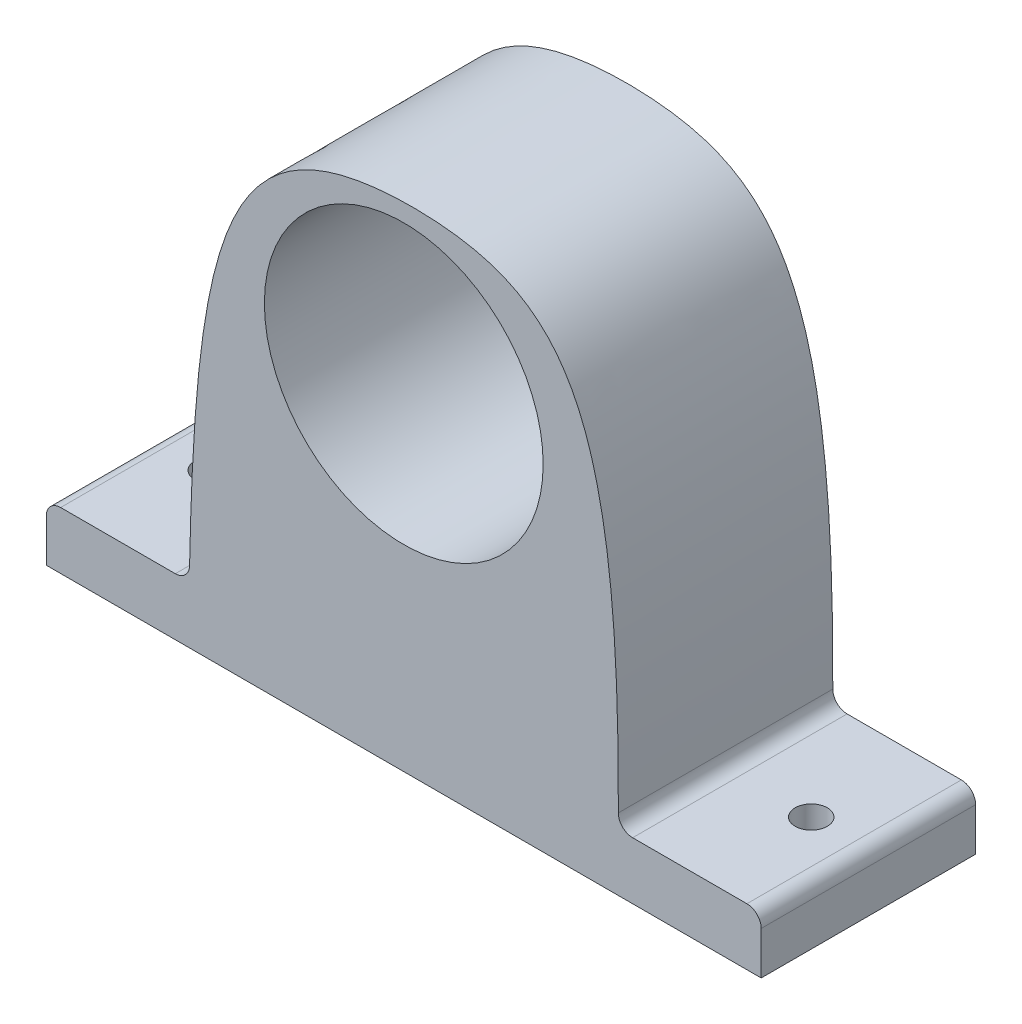
ISO-10303-21;
HEADER;
FILE_DESCRIPTION(('STEP AP214'),'2;1');
FILE_NAME('part.step','',(''),(''),'','','');
FILE_SCHEMA(('AUTOMOTIVE_DESIGN { 1 0 10303 214 1 1 1 1 }'));
ENDSEC;
DATA;
#1=APPLICATION_CONTEXT('core data for automotive mechanical design processes');
#2=APPLICATION_PROTOCOL_DEFINITION('international standard','automotive_design',2000,#1);
#3=PRODUCT_CONTEXT('',#1,'mechanical');
#4=PRODUCT('Part','Part','',(#3));
#5=PRODUCT_RELATED_PRODUCT_CATEGORY('part','',(#4));
#6=PRODUCT_DEFINITION_FORMATION('','',#4);
#7=PRODUCT_DEFINITION_CONTEXT('part definition',#1,'design');
#8=PRODUCT_DEFINITION('design','',#6,#7);
#9=PRODUCT_DEFINITION_SHAPE('','',#8);
#10=(LENGTH_UNIT() NAMED_UNIT(*) SI_UNIT(.MILLI.,.METRE.));
#11=(NAMED_UNIT(*) PLANE_ANGLE_UNIT() SI_UNIT($,.RADIAN.));
#12=(NAMED_UNIT(*) SI_UNIT($,.STERADIAN.) SOLID_ANGLE_UNIT());
#13=UNCERTAINTY_MEASURE_WITH_UNIT(LENGTH_MEASURE(1.E-05),#10,'distance_accuracy_value','');
#14=(GEOMETRIC_REPRESENTATION_CONTEXT(3) GLOBAL_UNCERTAINTY_ASSIGNED_CONTEXT((#13)) GLOBAL_UNIT_ASSIGNED_CONTEXT((#10,
#11,#12)) REPRESENTATION_CONTEXT('',''));
#15=CARTESIAN_POINT('',(0.,0.,0.));
#16=DIRECTION('',(0.,0.,1.));
#17=DIRECTION('',(1.,0.,0.));
#18=AXIS2_PLACEMENT_3D('',#15,#16,#17);
#19=CARTESIAN_POINT('',(0.,8.,0.));
#20=DIRECTION('',(0.,1.,0.));
#21=DIRECTION('',(0.,0.,1.));
#22=AXIS2_PLACEMENT_3D('',#19,#20,#21);
#23=PLANE('',#22);
#24=CARTESIAN_POINT('',(42.,8.,0.));
#25=DIRECTION('',(0.,1.,0.));
#26=DIRECTION('',(0.,0.,1.));
#27=AXIS2_PLACEMENT_3D('',#24,#25,#26);
#28=CIRCLE('',#27,2.25);
#29=CARTESIAN_POINT('',(42.,8.,2.25));
#30=VERTEX_POINT('',#29);
#31=EDGE_CURVE('E266',#30,#30,#28,.T.);
#32=ORIENTED_EDGE('',*,*,#31,.F.);
#33=EDGE_LOOP('',(#32));
#34=FACE_BOUND('',#33,.T.);
#35=DIRECTION('',(-1.,0.,0.));
#36=VECTOR('',#35,1.);
#37=CARTESIAN_POINT('',(-50.,8.,-15.));
#38=LINE('',#37,#36);
#39=CARTESIAN_POINT('',(48.,8.,-15.));
#40=VERTEX_POINT('',#39);
#41=CARTESIAN_POINT('',(32.0143725813341,8.,-15.));
#42=VERTEX_POINT('',#41);
#43=EDGE_CURVE('E202',#40,#42,#38,.T.);
#44=ORIENTED_EDGE('',*,*,#43,.T.);
#45=DIRECTION('',(0.,0.,-1.));
#46=VECTOR('',#45,1.);
#47=CARTESIAN_POINT('',(32.0143725813341,8.,15.));
#48=LINE('',#47,#46);
#49=CARTESIAN_POINT('',(32.0143725813341,8.,15.));
#50=VERTEX_POINT('',#49);
#51=EDGE_CURVE('E153',#42,#50,#48,.F.);
#52=ORIENTED_EDGE('',*,*,#51,.T.);
#53=DIRECTION('',(1.,0.,0.));
#54=VECTOR('',#53,1.);
#55=CARTESIAN_POINT('',(-50.,8.,15.));
#56=LINE('',#55,#54);
#57=CARTESIAN_POINT('',(48.,8.,15.));
#58=VERTEX_POINT('',#57);
#59=EDGE_CURVE('E190',#50,#58,#56,.T.);
#60=ORIENTED_EDGE('',*,*,#59,.T.);
#61=DIRECTION('',(0.,0.,-1.));
#62=VECTOR('',#61,1.);
#63=CARTESIAN_POINT('',(48.,8.,-15.));
#64=LINE('',#63,#62);
#65=EDGE_CURVE('E120',#58,#40,#64,.T.);
#66=ORIENTED_EDGE('',*,*,#65,.T.);
#67=EDGE_LOOP('',(#44,#52,#60,#66));
#68=FACE_BOUND('',#67,.T.);
#69=ADVANCED_FACE('F35',(#34,#68),#23,.T.);
#70=CARTESIAN_POINT('',(50.,8.,-15.));
#71=DIRECTION('',(-1.,0.,0.));
#72=DIRECTION('',(0.,0.,1.));
#73=AXIS2_PLACEMENT_3D('',#70,#71,#72);
#74=PLANE('',#73);
#75=DIRECTION('',(0.,-1.,0.));
#76=VECTOR('',#75,1.);
#77=CARTESIAN_POINT('',(50.,8.,-15.));
#78=LINE('',#77,#76);
#79=CARTESIAN_POINT('',(50.,6.,-15.));
#80=VERTEX_POINT('',#79);
#81=CARTESIAN_POINT('',(50.,0.,-15.));
#82=VERTEX_POINT('',#81);
#83=EDGE_CURVE('E111',#80,#82,#78,.T.);
#84=ORIENTED_EDGE('',*,*,#83,.F.);
#85=DIRECTION('',(0.,0.,-1.));
#86=VECTOR('',#85,1.);
#87=CARTESIAN_POINT('',(50.,6.,15.));
#88=LINE('',#87,#86);
#89=CARTESIAN_POINT('',(50.,6.,15.));
#90=VERTEX_POINT('',#89);
#91=EDGE_CURVE('E58',#80,#90,#88,.F.);
#92=ORIENTED_EDGE('',*,*,#91,.T.);
#93=DIRECTION('',(0.,-1.,0.));
#94=VECTOR('',#93,1.);
#95=CARTESIAN_POINT('',(50.,8.,15.));
#96=LINE('',#95,#94);
#97=CARTESIAN_POINT('',(50.,0.,15.));
#98=VERTEX_POINT('',#97);
#99=EDGE_CURVE('E132',#90,#98,#96,.T.);
#100=ORIENTED_EDGE('',*,*,#99,.T.);
#101=DIRECTION('',(0.,0.,-1.));
#102=VECTOR('',#101,1.);
#103=CARTESIAN_POINT('',(50.,0.,-15.));
#104=LINE('',#103,#102);
#105=EDGE_CURVE('E127',#98,#82,#104,.T.);
#106=ORIENTED_EDGE('',*,*,#105,.T.);
#107=EDGE_LOOP('',(#84,#92,#100,#106));
#108=FACE_BOUND('',#107,.T.);
#109=ADVANCED_FACE('F131',(#108),#74,.F.);
#110=CARTESIAN_POINT('',(-50.,8.,-15.));
#111=DIRECTION('',(0.,0.,1.));
#112=DIRECTION('',(1.,0.,0.));
#113=AXIS2_PLACEMENT_3D('',#110,#111,#112);
#114=PLANE('',#113);
#115=CARTESIAN_POINT('',(0.,47.,-15.));
#116=DIRECTION('',(0.,0.,1.));
#117=DIRECTION('',(1.,0.,0.));
#118=AXIS2_PLACEMENT_3D('',#115,#116,#117);
#119=CIRCLE('',#118,19.5);
#120=CARTESIAN_POINT('',(19.5,47.,-15.));
#121=VERTEX_POINT('',#120);
#122=EDGE_CURVE('E211',#121,#121,#119,.T.);
#123=ORIENTED_EDGE('',*,*,#122,.T.);
#124=EDGE_LOOP('',(#123));
#125=FACE_BOUND('',#124,.T.);
#126=ORIENTED_EDGE('',*,*,#43,.F.);
#127=CARTESIAN_POINT('',(48.,6.,-15.));
#128=DIRECTION('',(0.,0.,1.));
#129=DIRECTION('',(1.,0.,0.));
#130=AXIS2_PLACEMENT_3D('',#127,#128,#129);
#131=CIRCLE('',#130,2.);
#132=EDGE_CURVE('E118',#40,#80,#131,.F.);
#133=ORIENTED_EDGE('',*,*,#132,.T.);
#134=ORIENTED_EDGE('',*,*,#83,.T.);
#135=DIRECTION('',(-1.,0.,0.));
#136=VECTOR('',#135,1.);
#137=CARTESIAN_POINT('',(-50.,0.,-15.));
#138=LINE('',#137,#136);
#139=CARTESIAN_POINT('',(-50.,0.,-15.));
#140=VERTEX_POINT('',#139);
#141=EDGE_CURVE('E116',#82,#140,#138,.T.);
#142=ORIENTED_EDGE('',*,*,#141,.T.);
#143=DIRECTION('',(0.,-1.,0.));
#144=VECTOR('',#143,1.);
#145=CARTESIAN_POINT('',(-50.,8.,-15.));
#146=LINE('',#145,#144);
#147=CARTESIAN_POINT('',(-50.,6.,-15.));
#148=VERTEX_POINT('',#147);
#149=EDGE_CURVE('E121',#148,#140,#146,.T.);
#150=ORIENTED_EDGE('',*,*,#149,.F.);
#151=CARTESIAN_POINT('',(-48.,6.,-15.));
#152=DIRECTION('',(0.,0.,1.));
#153=DIRECTION('',(1.,0.,0.));
#154=AXIS2_PLACEMENT_3D('',#151,#152,#153);
#155=CIRCLE('',#154,2.);
#156=CARTESIAN_POINT('',(-48.,8.,-15.));
#157=VERTEX_POINT('',#156);
#158=EDGE_CURVE('E166',#148,#157,#155,.F.);
#159=ORIENTED_EDGE('',*,*,#158,.T.);
#160=CARTESIAN_POINT('',(-31.9615397004483,8.,-15.));
#161=VERTEX_POINT('',#160);
#162=EDGE_CURVE('E146',#161,#157,#38,.T.);
#163=ORIENTED_EDGE('',*,*,#162,.F.);
#164=CARTESIAN_POINT('',(-31.9615397004483,9.99999999999999,-15.));
#165=DIRECTION('',(0.,0.,1.));
#166=DIRECTION('',(1.,0.,0.));
#167=AXIS2_PLACEMENT_3D('',#164,#165,#166);
#168=CIRCLE('',#167,2.);
#169=CARTESIAN_POINT('',(-29.961975761432,9.95823813000134,-15.));
#170=VERTEX_POINT('',#169);
#171=EDGE_CURVE('E11',#161,#170,#168,.T.);
#172=ORIENTED_EDGE('',*,*,#171,.T.);
#173=CARTESIAN_POINT('',(30.,7.99999999999988,-15.));
#174=CARTESIAN_POINT('',(30.4408025854963,55.3810531329873,-15.));
#175=CARTESIAN_POINT('',(21.9240407428457,69.7151543853368,-15.));
#176=CARTESIAN_POINT('',(-25.0594519853736,68.4938476291659,-15.));
#177=CARTESIAN_POINT('',(-29.2948481921553,47.1595503730659,-15.));
#178=CARTESIAN_POINT('',(-30.,8.,-15.));
#179=B_SPLINE_CURVE_WITH_KNOTS('',3,(#173,#174,#175,#176,#177,#178),.UNSPECIFIED.,.F.,.F.,(4,1,
1,4),(0.,0.424752904805303,0.524752904805303,1.),.UNSPECIFIED.);
#180=CARTESIAN_POINT('',(30.0143972889691,10.0099413243421,-15.));
#181=VERTEX_POINT('',#180);
#182=EDGE_CURVE('E134',#170,#181,#179,.F.);
#183=ORIENTED_EDGE('',*,*,#182,.T.);
#184=CARTESIAN_POINT('',(32.0143725813341,10.,-15.));
#185=DIRECTION('',(0.,0.,1.));
#186=DIRECTION('',(1.,0.,0.));
#187=AXIS2_PLACEMENT_3D('',#184,#185,#186);
#188=CIRCLE('',#187,2.);
#189=EDGE_CURVE('E177',#181,#42,#188,.T.);
#190=ORIENTED_EDGE('',*,*,#189,.T.);
#191=EDGE_LOOP('',(#126,#133,#134,#142,#150,#159,#163,#172,#183,#190));
#192=FACE_BOUND('',#191,.T.);
#193=ADVANCED_FACE('F114',(#125,#192),#114,.F.);
#194=CARTESIAN_POINT('',(-50.,8.,-15.));
#195=DIRECTION('',(1.,0.,0.));
#196=DIRECTION('',(0.,0.,-1.));
#197=AXIS2_PLACEMENT_3D('',#194,#195,#196);
#198=PLANE('',#197);
#199=DIRECTION('',(0.,-1.,0.));
#200=VECTOR('',#199,1.);
#201=CARTESIAN_POINT('',(-50.,8.,15.));
#202=LINE('',#201,#200);
#203=CARTESIAN_POINT('',(-50.,6.,15.));
#204=VERTEX_POINT('',#203);
#205=CARTESIAN_POINT('',(-50.,0.,15.));
#206=VERTEX_POINT('',#205);
#207=EDGE_CURVE('E148',#204,#206,#202,.T.);
#208=ORIENTED_EDGE('',*,*,#207,.F.);
#209=DIRECTION('',(0.,0.,1.));
#210=VECTOR('',#209,1.);
#211=CARTESIAN_POINT('',(-50.,6.,-15.));
#212=LINE('',#211,#210);
#213=EDGE_CURVE('E173',#204,#148,#212,.F.);
#214=ORIENTED_EDGE('',*,*,#213,.T.);
#215=ORIENTED_EDGE('',*,*,#149,.T.);
#216=DIRECTION('',(0.,0.,1.));
#217=VECTOR('',#216,1.);
#218=CARTESIAN_POINT('',(-50.,0.,-15.));
#219=LINE('',#218,#217);
#220=EDGE_CURVE('E129',#140,#206,#219,.T.);
#221=ORIENTED_EDGE('',*,*,#220,.T.);
#222=EDGE_LOOP('',(#208,#214,#215,#221));
#223=FACE_BOUND('',#222,.T.);
#224=ADVANCED_FACE('F238',(#223),#198,.F.);
#225=CARTESIAN_POINT('',(-50.,8.,15.));
#226=DIRECTION('',(0.,0.,-1.));
#227=DIRECTION('',(-1.,0.,0.));
#228=AXIS2_PLACEMENT_3D('',#225,#226,#227);
#229=PLANE('',#228);
#230=CARTESIAN_POINT('',(0.,47.,15.));
#231=DIRECTION('',(0.,0.,1.));
#232=DIRECTION('',(1.,0.,0.));
#233=AXIS2_PLACEMENT_3D('',#230,#231,#232);
#234=CIRCLE('',#233,19.5);
#235=CARTESIAN_POINT('',(19.5,47.,15.));
#236=VERTEX_POINT('',#235);
#237=EDGE_CURVE('E276',#236,#236,#234,.T.);
#238=ORIENTED_EDGE('',*,*,#237,.F.);
#239=EDGE_LOOP('',(#238));
#240=FACE_BOUND('',#239,.T.);
#241=ORIENTED_EDGE('',*,*,#99,.F.);
#242=CARTESIAN_POINT('',(48.,6.,15.));
#243=DIRECTION('',(0.,0.,-1.));
#244=DIRECTION('',(-1.,0.,0.));
#245=AXIS2_PLACEMENT_3D('',#242,#243,#244);
#246=CIRCLE('',#245,2.);
#247=EDGE_CURVE('E171',#90,#58,#246,.F.);
#248=ORIENTED_EDGE('',*,*,#247,.T.);
#249=ORIENTED_EDGE('',*,*,#59,.F.);
#250=CARTESIAN_POINT('',(32.0143725813341,10.,15.));
#251=DIRECTION('',(0.,0.,-1.));
#252=DIRECTION('',(-1.,0.,0.));
#253=AXIS2_PLACEMENT_3D('',#250,#251,#252);
#254=CIRCLE('',#253,2.);
#255=CARTESIAN_POINT('',(30.0143972889691,10.0099413243421,15.));
#256=VERTEX_POINT('',#255);
#257=EDGE_CURVE('E175',#50,#256,#254,.T.);
#258=ORIENTED_EDGE('',*,*,#257,.T.);
#259=CARTESIAN_POINT('',(30.,7.99999999999988,15.));
#260=CARTESIAN_POINT('',(30.4408025854963,55.3810531329873,15.));
#261=CARTESIAN_POINT('',(21.9240407428457,69.7151543853368,15.));
#262=CARTESIAN_POINT('',(-25.0594519853736,68.4938476291659,15.));
#263=CARTESIAN_POINT('',(-29.2948481921553,47.1595503730659,15.));
#264=CARTESIAN_POINT('',(-30.,8.,15.));
#265=B_SPLINE_CURVE_WITH_KNOTS('',3,(#259,#260,#261,#262,#263,#264),.UNSPECIFIED.,.F.,.F.,(4,1,
1,4),(0.,0.424752904805303,0.524752904805303,1.),.UNSPECIFIED.);
#266=CARTESIAN_POINT('',(-29.961975761432,9.95823813000134,15.));
#267=VERTEX_POINT('',#266);
#268=EDGE_CURVE('E137',#256,#267,#265,.T.);
#269=ORIENTED_EDGE('',*,*,#268,.T.);
#270=CARTESIAN_POINT('',(-31.9615397004483,9.99999999999999,15.));
#271=DIRECTION('',(0.,0.,-1.));
#272=DIRECTION('',(-1.,0.,0.));
#273=AXIS2_PLACEMENT_3D('',#270,#271,#272);
#274=CIRCLE('',#273,2.);
#275=CARTESIAN_POINT('',(-31.9615397004483,8.,15.));
#276=VERTEX_POINT('',#275);
#277=EDGE_CURVE('E43',#267,#276,#274,.T.);
#278=ORIENTED_EDGE('',*,*,#277,.T.);
#279=CARTESIAN_POINT('',(-48.,8.,15.));
#280=VERTEX_POINT('',#279);
#281=EDGE_CURVE('E140',#280,#276,#56,.T.);
#282=ORIENTED_EDGE('',*,*,#281,.F.);
#283=CARTESIAN_POINT('',(-48.,6.,15.));
#284=DIRECTION('',(0.,0.,-1.));
#285=DIRECTION('',(-1.,0.,0.));
#286=AXIS2_PLACEMENT_3D('',#283,#284,#285);
#287=CIRCLE('',#286,2.);
#288=EDGE_CURVE('E50',#280,#204,#287,.F.);
#289=ORIENTED_EDGE('',*,*,#288,.T.);
#290=ORIENTED_EDGE('',*,*,#207,.T.);
#291=DIRECTION('',(1.,0.,0.));
#292=VECTOR('',#291,1.);
#293=CARTESIAN_POINT('',(-50.,0.,15.));
#294=LINE('',#293,#292);
#295=EDGE_CURVE('E144',#206,#98,#294,.T.);
#296=ORIENTED_EDGE('',*,*,#295,.T.);
#297=EDGE_LOOP('',(#241,#248,#249,#258,#269,#278,#282,#289,#290,#296));
#298=FACE_BOUND('',#297,.T.);
#299=ADVANCED_FACE('F180',(#240,#298),#229,.F.);
#300=CARTESIAN_POINT('',(-42.,8.,0.));
#301=DIRECTION('',(0.,1.,0.));
#302=DIRECTION('',(0.,0.,1.));
#303=AXIS2_PLACEMENT_3D('',#300,#301,#302);
#304=CIRCLE('',#303,2.25);
#305=CARTESIAN_POINT('',(-42.,8.,2.25));
#306=VERTEX_POINT('',#305);
#307=EDGE_CURVE('E271',#306,#306,#304,.T.);
#308=ORIENTED_EDGE('',*,*,#307,.F.);
#309=EDGE_LOOP('',(#308));
#310=FACE_BOUND('',#309,.T.);
#311=ORIENTED_EDGE('',*,*,#281,.T.);
#312=DIRECTION('',(0.,0.,-1.));
#313=VECTOR('',#312,1.);
#314=CARTESIAN_POINT('',(-31.9615397004483,8.,-15.));
#315=LINE('',#314,#313);
#316=EDGE_CURVE('E164',#276,#161,#315,.T.);
#317=ORIENTED_EDGE('',*,*,#316,.T.);
#318=ORIENTED_EDGE('',*,*,#162,.T.);
#319=DIRECTION('',(0.,0.,1.));
#320=VECTOR('',#319,1.);
#321=CARTESIAN_POINT('',(-48.,8.,15.));
#322=LINE('',#321,#320);
#323=EDGE_CURVE('E161',#157,#280,#322,.T.);
#324=ORIENTED_EDGE('',*,*,#323,.T.);
#325=EDGE_LOOP('',(#311,#317,#318,#324));
#326=FACE_BOUND('',#325,.T.);
#327=ADVANCED_FACE('F186',(#310,#326),#23,.T.);
#328=CARTESIAN_POINT('',(0.,0.,0.));
#329=DIRECTION('',(0.,1.,0.));
#330=DIRECTION('',(0.,0.,1.));
#331=AXIS2_PLACEMENT_3D('',#328,#329,#330);
#332=PLANE('',#331);
#333=CARTESIAN_POINT('',(-42.,0.,0.));
#334=DIRECTION('',(0.,1.,0.));
#335=DIRECTION('',(0.,0.,1.));
#336=AXIS2_PLACEMENT_3D('',#333,#334,#335);
#337=CIRCLE('',#336,2.25);
#338=CARTESIAN_POINT('',(-42.,0.,2.25));
#339=VERTEX_POINT('',#338);
#340=EDGE_CURVE('E278',#339,#339,#337,.T.);
#341=ORIENTED_EDGE('',*,*,#340,.T.);
#342=EDGE_LOOP('',(#341));
#343=FACE_BOUND('',#342,.T.);
#344=CARTESIAN_POINT('',(42.,0.,0.));
#345=DIRECTION('',(0.,1.,0.));
#346=DIRECTION('',(0.,0.,1.));
#347=AXIS2_PLACEMENT_3D('',#344,#345,#346);
#348=CIRCLE('',#347,2.25);
#349=CARTESIAN_POINT('',(42.,0.,2.25));
#350=VERTEX_POINT('',#349);
#351=EDGE_CURVE('E268',#350,#350,#348,.T.);
#352=ORIENTED_EDGE('',*,*,#351,.T.);
#353=EDGE_LOOP('',(#352));
#354=FACE_BOUND('',#353,.T.);
#355=ORIENTED_EDGE('',*,*,#105,.F.);
#356=ORIENTED_EDGE('',*,*,#295,.F.);
#357=ORIENTED_EDGE('',*,*,#220,.F.);
#358=ORIENTED_EDGE('',*,*,#141,.F.);
#359=EDGE_LOOP('',(#355,#356,#357,#358));
#360=FACE_BOUND('',#359,.T.);
#361=ADVANCED_FACE('F125',(#343,#354,#360),#332,.F.);
#362=CARTESIAN_POINT('',(30.,7.99999999999988,-136.902431275883));
#363=CARTESIAN_POINT('',(30.4408025854963,55.3810531329873,-136.902431275883));
#364=CARTESIAN_POINT('',(21.9240407428457,69.7151543853368,-136.902431275883));
#365=CARTESIAN_POINT('',(-25.0594519853736,68.4938476291659,-136.902431275883));
#366=CARTESIAN_POINT('',(-29.2948481921553,47.1595503730659,-136.902431275883));
#367=CARTESIAN_POINT('',(-30.,8.,-136.902431275883));
#368=B_SPLINE_CURVE_WITH_KNOTS('',3,(#362,#363,#364,#365,#366,#367),.UNSPECIFIED.,.F.,.F.,(4,1,
1,4),(0.,0.424752904805303,0.524752904805303,1.),.UNSPECIFIED.);
#369=DIRECTION('',(0.,0.,1.));
#370=VECTOR('',#369,1.);
#371=SURFACE_OF_LINEAR_EXTRUSION('',#368,#370);
#372=ORIENTED_EDGE('',*,*,#268,.F.);
#373=DIRECTION('',(0.,0.,1.));
#374=VECTOR('',#373,1.);
#375=CARTESIAN_POINT('',(30.0143972889691,10.0099413243421,15.));
#376=LINE('',#375,#374);
#377=EDGE_CURVE('E159',#256,#181,#376,.F.);
#378=ORIENTED_EDGE('',*,*,#377,.T.);
#379=ORIENTED_EDGE('',*,*,#182,.F.);
#380=DIRECTION('',(0.,0.,1.));
#381=VECTOR('',#380,1.);
#382=CARTESIAN_POINT('',(-29.961975761432,9.95823813000134,-15.));
#383=LINE('',#382,#381);
#384=EDGE_CURVE('E156',#170,#267,#383,.T.);
#385=ORIENTED_EDGE('',*,*,#384,.T.);
#386=EDGE_LOOP('',(#372,#378,#379,#385));
#387=FACE_BOUND('',#386,.T.);
#388=ADVANCED_FACE('F196',(#387),#371,.T.);
#389=CARTESIAN_POINT('',(0.,47.,-15.));
#390=DIRECTION('',(0.,0.,1.));
#391=DIRECTION('',(1.,0.,0.));
#392=AXIS2_PLACEMENT_3D('',#389,#390,#391);
#393=CYLINDRICAL_SURFACE('',#392,19.5);
#394=ORIENTED_EDGE('',*,*,#122,.F.);
#395=EDGE_LOOP('',(#394));
#396=FACE_BOUND('',#395,.T.);
#397=ORIENTED_EDGE('',*,*,#237,.T.);
#398=EDGE_LOOP('',(#397));
#399=FACE_BOUND('',#398,.T.);
#400=ADVANCED_FACE('F228',(#396,#399),#393,.F.);
#401=CARTESIAN_POINT('',(42.,0.,0.));
#402=DIRECTION('',(0.,1.,0.));
#403=DIRECTION('',(0.,0.,1.));
#404=AXIS2_PLACEMENT_3D('',#401,#402,#403);
#405=CYLINDRICAL_SURFACE('',#404,2.25);
#406=ORIENTED_EDGE('',*,*,#351,.F.);
#407=EDGE_LOOP('',(#406));
#408=FACE_BOUND('',#407,.T.);
#409=ORIENTED_EDGE('',*,*,#31,.T.);
#410=EDGE_LOOP('',(#409));
#411=FACE_BOUND('',#410,.T.);
#412=ADVANCED_FACE('F288',(#408,#411),#405,.F.);
#413=CARTESIAN_POINT('',(-42.,0.,0.));
#414=DIRECTION('',(0.,1.,0.));
#415=DIRECTION('',(0.,0.,1.));
#416=AXIS2_PLACEMENT_3D('',#413,#414,#415);
#417=CYLINDRICAL_SURFACE('',#416,2.25);
#418=ORIENTED_EDGE('',*,*,#340,.F.);
#419=EDGE_LOOP('',(#418));
#420=FACE_BOUND('',#419,.T.);
#421=ORIENTED_EDGE('',*,*,#307,.T.);
#422=EDGE_LOOP('',(#421));
#423=FACE_BOUND('',#422,.T.);
#424=ADVANCED_FACE('F250',(#420,#423),#417,.F.);
#425=CARTESIAN_POINT('',(32.0143725813341,10.,-1.66533453693773E-13));
#426=DIRECTION('',(0.,0.,1.));
#427=DIRECTION('',(1.,0.,0.));
#428=AXIS2_PLACEMENT_3D('',#425,#426,#427);
#429=CYLINDRICAL_SURFACE('',#428,2.);
#430=ORIENTED_EDGE('',*,*,#189,.F.);
#431=ORIENTED_EDGE('',*,*,#377,.F.);
#432=ORIENTED_EDGE('',*,*,#257,.F.);
#433=ORIENTED_EDGE('',*,*,#51,.F.);
#434=EDGE_LOOP('',(#430,#431,#432,#433));
#435=FACE_BOUND('',#434,.T.);
#436=ADVANCED_FACE('F199',(#435),#429,.F.);
#437=CARTESIAN_POINT('',(-31.9615397004483,9.99999999999999,0.));
#438=DIRECTION('',(0.,0.,1.));
#439=DIRECTION('',(1.,0.,0.));
#440=AXIS2_PLACEMENT_3D('',#437,#438,#439);
#441=CYLINDRICAL_SURFACE('',#440,2.);
#442=ORIENTED_EDGE('',*,*,#171,.F.);
#443=ORIENTED_EDGE('',*,*,#316,.F.);
#444=ORIENTED_EDGE('',*,*,#277,.F.);
#445=ORIENTED_EDGE('',*,*,#384,.F.);
#446=EDGE_LOOP('',(#442,#443,#444,#445));
#447=FACE_BOUND('',#446,.T.);
#448=ADVANCED_FACE('F192',(#447),#441,.F.);
#449=CARTESIAN_POINT('',(48.,6.,0.));
#450=DIRECTION('',(0.,0.,1.));
#451=DIRECTION('',(1.,0.,0.));
#452=AXIS2_PLACEMENT_3D('',#449,#450,#451);
#453=CYLINDRICAL_SURFACE('',#452,2.);
#454=ORIENTED_EDGE('',*,*,#247,.F.);
#455=ORIENTED_EDGE('',*,*,#91,.F.);
#456=ORIENTED_EDGE('',*,*,#132,.F.);
#457=ORIENTED_EDGE('',*,*,#65,.F.);
#458=EDGE_LOOP('',(#454,#455,#456,#457));
#459=FACE_BOUND('',#458,.T.);
#460=ADVANCED_FACE('F252',(#459),#453,.T.);
#461=CARTESIAN_POINT('',(-48.,6.,0.));
#462=DIRECTION('',(0.,0.,-1.));
#463=DIRECTION('',(-1.,0.,0.));
#464=AXIS2_PLACEMENT_3D('',#461,#462,#463);
#465=CYLINDRICAL_SURFACE('',#464,2.);
#466=ORIENTED_EDGE('',*,*,#158,.F.);
#467=ORIENTED_EDGE('',*,*,#213,.F.);
#468=ORIENTED_EDGE('',*,*,#288,.F.);
#469=ORIENTED_EDGE('',*,*,#323,.F.);
#470=EDGE_LOOP('',(#466,#467,#468,#469));
#471=FACE_BOUND('',#470,.T.);
#472=ADVANCED_FACE('F37',(#471),#465,.T.);
#473=CLOSED_SHELL('',(#69,#109,#193,#224,#299,#327,#361,#388,#400,#412,#424,#436,#448,#460,#472));
#474=MANIFOLD_SOLID_BREP('B2',#473);
#475=ADVANCED_BREP_SHAPE_REPRESENTATION('',(#18,#474),#14);
#476=SHAPE_DEFINITION_REPRESENTATION(#9,#475);
ENDSEC;
END-ISO-10303-21;
